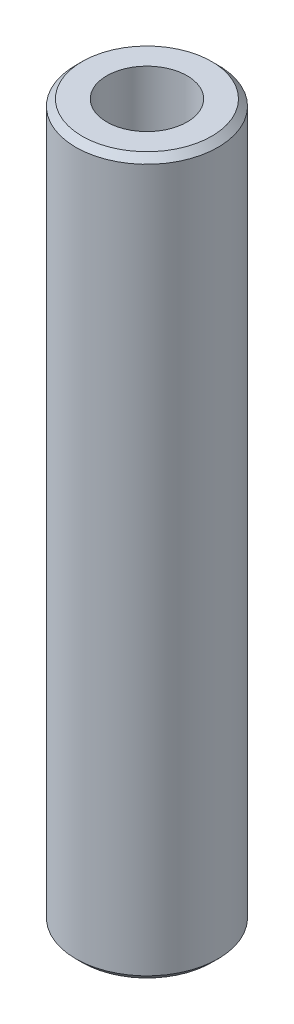
ISO-10303-21;
HEADER;
FILE_DESCRIPTION(('STEP AP214'),'2;1');
FILE_NAME('part.step','',(''),(''),'','','');
FILE_SCHEMA(('AUTOMOTIVE_DESIGN { 1 0 10303 214 1 1 1 1 }'));
ENDSEC;
DATA;
#1=APPLICATION_CONTEXT('core data for automotive mechanical design processes');
#2=APPLICATION_PROTOCOL_DEFINITION('international standard','automotive_design',2000,#1);
#3=PRODUCT_CONTEXT('',#1,'mechanical');
#4=PRODUCT('Part','Part','',(#3));
#5=PRODUCT_RELATED_PRODUCT_CATEGORY('part','',(#4));
#6=PRODUCT_DEFINITION_FORMATION('','',#4);
#7=PRODUCT_DEFINITION_CONTEXT('part definition',#1,'design');
#8=PRODUCT_DEFINITION('design','',#6,#7);
#9=PRODUCT_DEFINITION_SHAPE('','',#8);
#10=(LENGTH_UNIT() NAMED_UNIT(*) SI_UNIT(.MILLI.,.METRE.));
#11=(NAMED_UNIT(*) PLANE_ANGLE_UNIT() SI_UNIT($,.RADIAN.));
#12=(NAMED_UNIT(*) SI_UNIT($,.STERADIAN.) SOLID_ANGLE_UNIT());
#13=UNCERTAINTY_MEASURE_WITH_UNIT(LENGTH_MEASURE(1.E-05),#10,'distance_accuracy_value','');
#14=(GEOMETRIC_REPRESENTATION_CONTEXT(3) GLOBAL_UNCERTAINTY_ASSIGNED_CONTEXT((#13)) GLOBAL_UNIT_ASSIGNED_CONTEXT((#10,
#11,#12)) REPRESENTATION_CONTEXT('',''));
#15=CARTESIAN_POINT('',(0.,0.,0.));
#16=DIRECTION('',(0.,0.,1.));
#17=DIRECTION('',(1.,0.,0.));
#18=AXIS2_PLACEMENT_3D('',#15,#16,#17);
#19=CARTESIAN_POINT('',(0.,377.227544864555,0.));
#20=DIRECTION('',(0.,-1.,0.));
#21=DIRECTION('',(0.,0.,-1.));
#22=AXIS2_PLACEMENT_3D('',#19,#20,#21);
#23=CYLINDRICAL_SURFACE('',#22,37.5);
#24=CARTESIAN_POINT('',(0.,373.86060585202,0.));
#25=DIRECTION('',(0.,1.,0.));
#26=DIRECTION('',(0.,0.,1.));
#27=AXIS2_PLACEMENT_3D('',#24,#25,#26);
#28=CIRCLE('',#27,37.5);
#29=CARTESIAN_POINT('',(0.,373.86060585202,37.5));
#30=VERTEX_POINT('',#29);
#31=EDGE_CURVE('E50',#30,#30,#28,.F.);
#32=ORIENTED_EDGE('',*,*,#31,.T.);
#33=EDGE_LOOP('',(#32));
#34=FACE_BOUND('',#33,.T.);
#35=CARTESIAN_POINT('',(0.,3.3669390125351,0.));
#36=DIRECTION('',(0.,1.,0.));
#37=DIRECTION('',(0.,0.,1.));
#38=AXIS2_PLACEMENT_3D('',#35,#36,#37);
#39=CIRCLE('',#38,37.5);
#40=CARTESIAN_POINT('',(0.,3.3669390125351,37.5));
#41=VERTEX_POINT('',#40);
#42=EDGE_CURVE('E51',#41,#41,#39,.T.);
#43=ORIENTED_EDGE('',*,*,#42,.T.);
#44=EDGE_LOOP('',(#43));
#45=FACE_BOUND('',#44,.T.);
#46=ADVANCED_FACE('F39',(#34,#45),#23,.T.);
#47=CARTESIAN_POINT('',(0.,377.227544864555,0.));
#48=DIRECTION('',(0.,1.,0.));
#49=DIRECTION('',(0.,0.,1.));
#50=AXIS2_PLACEMENT_3D('',#47,#48,#49);
#51=PLANE('',#50);
#52=CARTESIAN_POINT('',(0.,377.227544864555,0.));
#53=DIRECTION('',(0.,1.,0.));
#54=DIRECTION('',(0.,0.,1.));
#55=AXIS2_PLACEMENT_3D('',#52,#53,#54);
#56=CIRCLE('',#55,34.1330609874649);
#57=CARTESIAN_POINT('',(0.,377.227544864555,34.1330609874649));
#58=VERTEX_POINT('',#57);
#59=EDGE_CURVE('E54',#58,#58,#56,.T.);
#60=ORIENTED_EDGE('',*,*,#59,.T.);
#61=EDGE_LOOP('',(#60));
#62=FACE_BOUND('',#61,.T.);
#63=CARTESIAN_POINT('',(0.,377.227544864555,0.));
#64=DIRECTION('',(0.,1.,0.));
#65=DIRECTION('',(0.,0.,1.));
#66=AXIS2_PLACEMENT_3D('',#63,#64,#65);
#67=CIRCLE('',#66,21.152646460993);
#68=CARTESIAN_POINT('',(0.,377.227544864555,21.152646460993));
#69=VERTEX_POINT('',#68);
#70=EDGE_CURVE('E58',#69,#69,#67,.T.);
#71=ORIENTED_EDGE('',*,*,#70,.F.);
#72=EDGE_LOOP('',(#71));
#73=FACE_BOUND('',#72,.T.);
#74=ADVANCED_FACE('F69',(#62,#73),#51,.T.);
#75=CARTESIAN_POINT('',(0.,0.,0.));
#76=DIRECTION('',(0.,1.,0.));
#77=DIRECTION('',(0.,0.,1.));
#78=AXIS2_PLACEMENT_3D('',#75,#76,#77);
#79=PLANE('',#78);
#80=CARTESIAN_POINT('',(0.,0.,0.));
#81=DIRECTION('',(0.,1.,0.));
#82=DIRECTION('',(0.,0.,1.));
#83=AXIS2_PLACEMENT_3D('',#80,#81,#82);
#84=CIRCLE('',#83,34.1330609874649);
#85=CARTESIAN_POINT('',(0.,0.,34.1330609874649));
#86=VERTEX_POINT('',#85);
#87=EDGE_CURVE('E10',#86,#86,#84,.F.);
#88=ORIENTED_EDGE('',*,*,#87,.T.);
#89=EDGE_LOOP('',(#88));
#90=FACE_BOUND('',#89,.T.);
#91=CARTESIAN_POINT('',(0.,0.,0.));
#92=DIRECTION('',(0.,1.,0.));
#93=DIRECTION('',(0.,0.,1.));
#94=AXIS2_PLACEMENT_3D('',#91,#92,#93);
#95=CIRCLE('',#94,21.152646460993);
#96=CARTESIAN_POINT('',(0.,0.,21.152646460993));
#97=VERTEX_POINT('',#96);
#98=EDGE_CURVE('E63',#97,#97,#95,.T.);
#99=ORIENTED_EDGE('',*,*,#98,.T.);
#100=EDGE_LOOP('',(#99));
#101=FACE_BOUND('',#100,.T.);
#102=ADVANCED_FACE('F75',(#90,#101),#79,.F.);
#103=CARTESIAN_POINT('',(0.,377.227544864555,0.));
#104=DIRECTION('',(0.,-1.,0.));
#105=DIRECTION('',(0.,0.,-1.));
#106=AXIS2_PLACEMENT_3D('',#103,#104,#105);
#107=CYLINDRICAL_SURFACE('',#106,21.152646460993);
#108=ORIENTED_EDGE('',*,*,#70,.T.);
#109=EDGE_LOOP('',(#108));
#110=FACE_BOUND('',#109,.T.);
#111=ORIENTED_EDGE('',*,*,#98,.F.);
#112=EDGE_LOOP('',(#111));
#113=FACE_BOUND('',#112,.T.);
#114=ADVANCED_FACE('F70',(#110,#113),#107,.F.);
#115=CARTESIAN_POINT('',(0.,377.227544864555,0.));
#116=DIRECTION('',(0.,-1.,0.));
#117=DIRECTION('',(0.,0.,-1.));
#118=AXIS2_PLACEMENT_3D('',#115,#116,#117);
#119=CONICAL_SURFACE('',#118,34.1330609874649,0.785398163397444);
#120=ORIENTED_EDGE('',*,*,#31,.F.);
#121=EDGE_LOOP('',(#120));
#122=FACE_BOUND('',#121,.T.);
#123=ORIENTED_EDGE('',*,*,#59,.F.);
#124=EDGE_LOOP('',(#123));
#125=FACE_BOUND('',#124,.T.);
#126=ADVANCED_FACE('F81',(#122,#125),#119,.T.);
#127=CARTESIAN_POINT('',(0.,3.3669390125351,0.));
#128=DIRECTION('',(0.,1.,0.));
#129=DIRECTION('',(0.,0.,1.));
#130=AXIS2_PLACEMENT_3D('',#127,#128,#129);
#131=CONICAL_SURFACE('',#130,37.5,0.785398163397457);
#132=ORIENTED_EDGE('',*,*,#87,.F.);
#133=EDGE_LOOP('',(#132));
#134=FACE_BOUND('',#133,.T.);
#135=ORIENTED_EDGE('',*,*,#42,.F.);
#136=EDGE_LOOP('',(#135));
#137=FACE_BOUND('',#136,.T.);
#138=ADVANCED_FACE('F45',(#134,#137),#131,.T.);
#139=CLOSED_SHELL('',(#46,#74,#102,#114,#126,#138));
#140=MANIFOLD_SOLID_BREP('B2',#139);
#141=ADVANCED_BREP_SHAPE_REPRESENTATION('',(#18,#140),#14);
#142=SHAPE_DEFINITION_REPRESENTATION(#9,#141);
ENDSEC;
END-ISO-10303-21;
